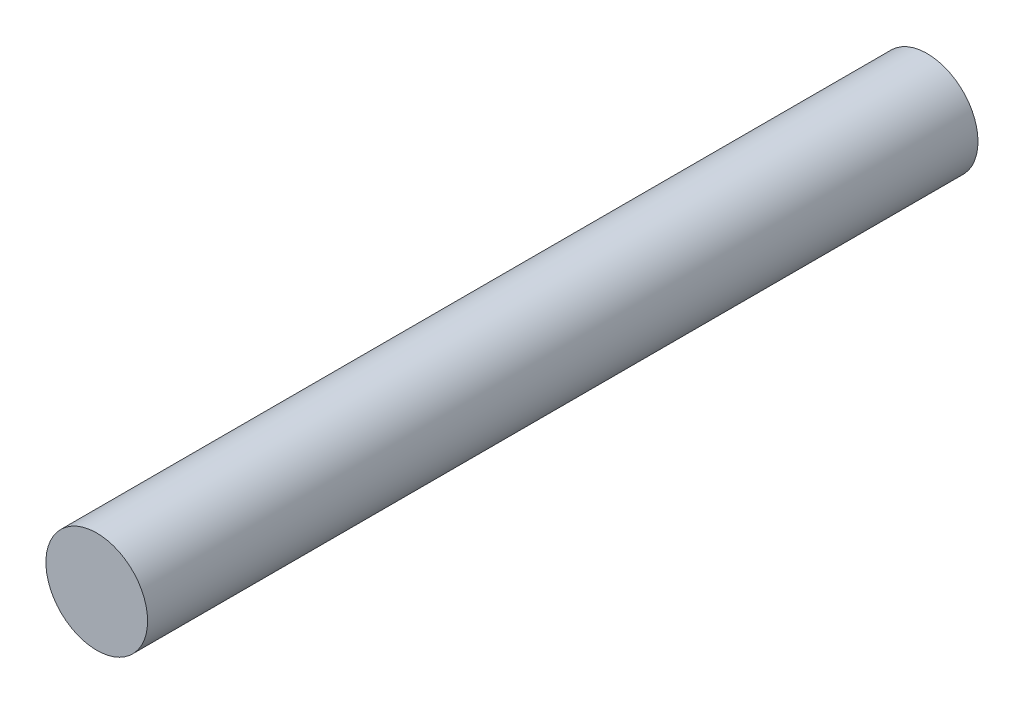
ISO-10303-21;
HEADER;
FILE_DESCRIPTION(('STEP AP214'),'2;1');
FILE_NAME('part.step','',(''),(''),'','','');
FILE_SCHEMA(('AUTOMOTIVE_DESIGN { 1 0 10303 214 1 1 1 1 }'));
ENDSEC;
DATA;
#1=APPLICATION_CONTEXT('core data for automotive mechanical design processes');
#2=APPLICATION_PROTOCOL_DEFINITION('international standard','automotive_design',2000,#1);
#3=PRODUCT_CONTEXT('',#1,'mechanical');
#4=PRODUCT('Part','Part','',(#3));
#5=PRODUCT_RELATED_PRODUCT_CATEGORY('part','',(#4));
#6=PRODUCT_DEFINITION_FORMATION('','',#4);
#7=PRODUCT_DEFINITION_CONTEXT('part definition',#1,'design');
#8=PRODUCT_DEFINITION('design','',#6,#7);
#9=PRODUCT_DEFINITION_SHAPE('','',#8);
#10=(LENGTH_UNIT() NAMED_UNIT(*) SI_UNIT(.MILLI.,.METRE.));
#11=(NAMED_UNIT(*) PLANE_ANGLE_UNIT() SI_UNIT($,.RADIAN.));
#12=(NAMED_UNIT(*) SI_UNIT($,.STERADIAN.) SOLID_ANGLE_UNIT());
#13=UNCERTAINTY_MEASURE_WITH_UNIT(LENGTH_MEASURE(1.E-05),#10,'distance_accuracy_value','');
#14=(GEOMETRIC_REPRESENTATION_CONTEXT(3) GLOBAL_UNCERTAINTY_ASSIGNED_CONTEXT((#13)) GLOBAL_UNIT_ASSIGNED_CONTEXT((#10,
#11,#12)) REPRESENTATION_CONTEXT('',''));
#15=CARTESIAN_POINT('',(0.,0.,0.));
#16=DIRECTION('',(0.,0.,1.));
#17=DIRECTION('',(1.,0.,0.));
#18=AXIS2_PLACEMENT_3D('',#15,#16,#17);
#19=CARTESIAN_POINT('',(0.,0.,49.));
#20=DIRECTION('',(0.,0.,-1.));
#21=DIRECTION('',(-1.,0.,0.));
#22=AXIS2_PLACEMENT_3D('',#19,#20,#21);
#23=CYLINDRICAL_SURFACE('',#22,3.);
#24=CARTESIAN_POINT('',(0.,0.,49.));
#25=DIRECTION('',(0.,0.,1.));
#26=DIRECTION('',(1.,0.,0.));
#27=AXIS2_PLACEMENT_3D('',#24,#25,#26);
#28=CIRCLE('',#27,3.);
#29=CARTESIAN_POINT('',(3.,0.,49.));
#30=VERTEX_POINT('',#29);
#31=EDGE_CURVE('E10',#30,#30,#28,.T.);
#32=ORIENTED_EDGE('',*,*,#31,.F.);
#33=EDGE_LOOP('',(#32));
#34=FACE_BOUND('',#33,.T.);
#35=CARTESIAN_POINT('',(0.,0.,0.));
#36=DIRECTION('',(0.,0.,1.));
#37=DIRECTION('',(1.,0.,0.));
#38=AXIS2_PLACEMENT_3D('',#35,#36,#37);
#39=CIRCLE('',#38,3.);
#40=CARTESIAN_POINT('',(3.,0.,0.));
#41=VERTEX_POINT('',#40);
#42=EDGE_CURVE('E32',#41,#41,#39,.T.);
#43=ORIENTED_EDGE('',*,*,#42,.T.);
#44=EDGE_LOOP('',(#43));
#45=FACE_BOUND('',#44,.T.);
#46=ADVANCED_FACE('F29',(#34,#45),#23,.T.);
#47=CARTESIAN_POINT('',(0.,0.,49.));
#48=DIRECTION('',(0.,0.,1.));
#49=DIRECTION('',(1.,0.,0.));
#50=AXIS2_PLACEMENT_3D('',#47,#48,#49);
#51=PLANE('',#50);
#52=ORIENTED_EDGE('',*,*,#31,.T.);
#53=EDGE_LOOP('',(#52));
#54=FACE_BOUND('',#53,.T.);
#55=ADVANCED_FACE('F44',(#54),#51,.T.);
#56=CARTESIAN_POINT('',(0.,0.,0.));
#57=DIRECTION('',(0.,0.,1.));
#58=DIRECTION('',(1.,0.,0.));
#59=AXIS2_PLACEMENT_3D('',#56,#57,#58);
#60=PLANE('',#59);
#61=ORIENTED_EDGE('',*,*,#42,.F.);
#62=EDGE_LOOP('',(#61));
#63=FACE_BOUND('',#62,.T.);
#64=ADVANCED_FACE('F42',(#63),#60,.F.);
#65=CLOSED_SHELL('',(#46,#55,#64));
#66=MANIFOLD_SOLID_BREP('B2',#65);
#67=ADVANCED_BREP_SHAPE_REPRESENTATION('',(#18,#66),#14);
#68=SHAPE_DEFINITION_REPRESENTATION(#9,#67);
ENDSEC;
END-ISO-10303-21;
